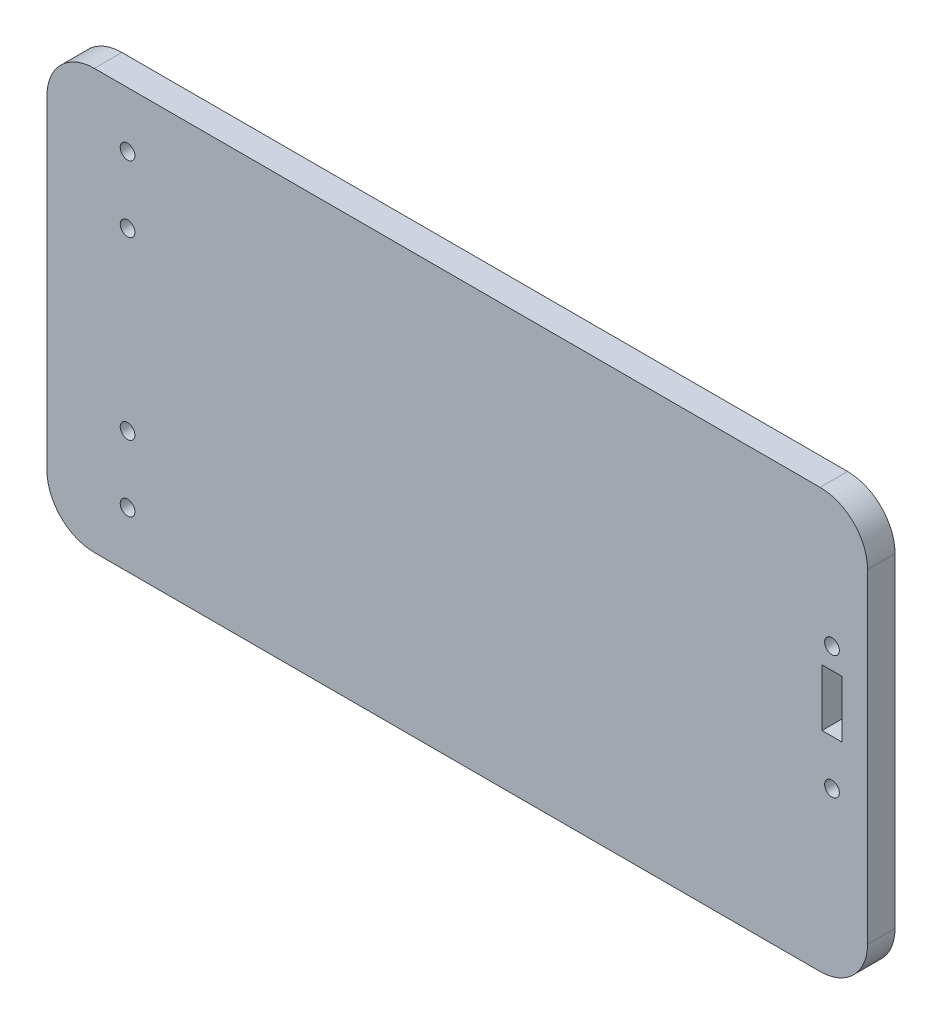
ISO-10303-21;
HEADER;
FILE_DESCRIPTION(('STEP AP214'),'2;1');
FILE_NAME('part.step','',(''),(''),'','','');
FILE_SCHEMA(('AUTOMOTIVE_DESIGN { 1 0 10303 214 1 1 1 1 }'));
ENDSEC;
DATA;
#1=APPLICATION_CONTEXT('core data for automotive mechanical design processes');
#2=APPLICATION_PROTOCOL_DEFINITION('international standard','automotive_design',2000,#1);
#3=PRODUCT_CONTEXT('',#1,'mechanical');
#4=PRODUCT('Part','Part','',(#3));
#5=PRODUCT_RELATED_PRODUCT_CATEGORY('part','',(#4));
#6=PRODUCT_DEFINITION_FORMATION('','',#4);
#7=PRODUCT_DEFINITION_CONTEXT('part definition',#1,'design');
#8=PRODUCT_DEFINITION('design','',#6,#7);
#9=PRODUCT_DEFINITION_SHAPE('','',#8);
#10=(LENGTH_UNIT() NAMED_UNIT(*) SI_UNIT(.MILLI.,.METRE.));
#11=(NAMED_UNIT(*) PLANE_ANGLE_UNIT() SI_UNIT($,.RADIAN.));
#12=(NAMED_UNIT(*) SI_UNIT($,.STERADIAN.) SOLID_ANGLE_UNIT());
#13=UNCERTAINTY_MEASURE_WITH_UNIT(LENGTH_MEASURE(1.E-05),#10,'distance_accuracy_value','');
#14=(GEOMETRIC_REPRESENTATION_CONTEXT(3) GLOBAL_UNCERTAINTY_ASSIGNED_CONTEXT((#13)) GLOBAL_UNIT_ASSIGNED_CONTEXT((#10,
#11,#12)) REPRESENTATION_CONTEXT('',''));
#15=CARTESIAN_POINT('',(0.,0.,0.));
#16=DIRECTION('',(0.,0.,1.));
#17=DIRECTION('',(1.,0.,0.));
#18=AXIS2_PLACEMENT_3D('',#15,#16,#17);
#19=CARTESIAN_POINT('',(163.,34.2,5.8));
#20=DIRECTION('',(0.,0.,-1.));
#21=DIRECTION('',(-1.,0.,0.));
#22=AXIS2_PLACEMENT_3D('',#19,#20,#21);
#23=CYLINDRICAL_SURFACE('',#22,10.);
#24=CARTESIAN_POINT('',(163.,34.2,0.));
#25=DIRECTION('',(0.,0.,1.));
#26=DIRECTION('',(1.,0.,0.));
#27=AXIS2_PLACEMENT_3D('',#24,#25,#26);
#28=CIRCLE('',#27,10.);
#29=CARTESIAN_POINT('',(173.,34.2,0.));
#30=VERTEX_POINT('',#29);
#31=CARTESIAN_POINT('',(163.,44.2,0.));
#32=VERTEX_POINT('',#31);
#33=EDGE_CURVE('E159',#30,#32,#28,.T.);
#34=ORIENTED_EDGE('',*,*,#33,.T.);
#35=DIRECTION('',(0.,0.,-1.));
#36=VECTOR('',#35,1.);
#37=CARTESIAN_POINT('',(163.,44.2,5.8));
#38=LINE('',#37,#36);
#39=CARTESIAN_POINT('',(163.,44.2,5.8));
#40=VERTEX_POINT('',#39);
#41=EDGE_CURVE('E241',#40,#32,#38,.T.);
#42=ORIENTED_EDGE('',*,*,#41,.F.);
#43=CARTESIAN_POINT('',(163.,34.2,5.8));
#44=DIRECTION('',(0.,0.,1.));
#45=DIRECTION('',(1.,0.,0.));
#46=AXIS2_PLACEMENT_3D('',#43,#44,#45);
#47=CIRCLE('',#46,10.);
#48=CARTESIAN_POINT('',(173.,34.2,5.8));
#49=VERTEX_POINT('',#48);
#50=EDGE_CURVE('E164',#49,#40,#47,.T.);
#51=ORIENTED_EDGE('',*,*,#50,.F.);
#52=DIRECTION('',(0.,0.,-1.));
#53=VECTOR('',#52,1.);
#54=CARTESIAN_POINT('',(173.,34.2,5.8));
#55=LINE('',#54,#53);
#56=EDGE_CURVE('E190',#49,#30,#55,.T.);
#57=ORIENTED_EDGE('',*,*,#56,.T.);
#58=EDGE_LOOP('',(#34,#42,#51,#57));
#59=FACE_BOUND('',#58,.T.);
#60=ADVANCED_FACE('F39',(#59),#23,.T.);
#61=CARTESIAN_POINT('',(163.,44.2,5.8));
#62=DIRECTION('',(0.,-1.,0.));
#63=DIRECTION('',(1.,0.,0.));
#64=AXIS2_PLACEMENT_3D('',#61,#62,#63);
#65=PLANE('',#64);
#66=DIRECTION('',(-1.,0.,0.));
#67=VECTOR('',#66,1.);
#68=CARTESIAN_POINT('',(163.,44.2,0.));
#69=LINE('',#68,#67);
#70=CARTESIAN_POINT('',(10.,44.2,0.));
#71=VERTEX_POINT('',#70);
#72=EDGE_CURVE('E194',#32,#71,#69,.T.);
#73=ORIENTED_EDGE('',*,*,#72,.T.);
#74=DIRECTION('',(0.,0.,-1.));
#75=VECTOR('',#74,1.);
#76=CARTESIAN_POINT('',(10.,44.2,5.8));
#77=LINE('',#76,#75);
#78=CARTESIAN_POINT('',(10.,44.2,5.8));
#79=VERTEX_POINT('',#78);
#80=EDGE_CURVE('E237',#79,#71,#77,.T.);
#81=ORIENTED_EDGE('',*,*,#80,.F.);
#82=DIRECTION('',(-1.,0.,0.));
#83=VECTOR('',#82,1.);
#84=CARTESIAN_POINT('',(163.,44.2,5.8));
#85=LINE('',#84,#83);
#86=EDGE_CURVE('E168',#40,#79,#85,.T.);
#87=ORIENTED_EDGE('',*,*,#86,.F.);
#88=ORIENTED_EDGE('',*,*,#41,.T.);
#89=EDGE_LOOP('',(#73,#81,#87,#88));
#90=FACE_BOUND('',#89,.T.);
#91=ADVANCED_FACE('F270',(#90),#65,.F.);
#92=CARTESIAN_POINT('',(10.,34.2,5.8));
#93=DIRECTION('',(0.,0.,-1.));
#94=DIRECTION('',(-1.,0.,0.));
#95=AXIS2_PLACEMENT_3D('',#92,#93,#94);
#96=CYLINDRICAL_SURFACE('',#95,10.);
#97=CARTESIAN_POINT('',(10.,34.2,0.));
#98=DIRECTION('',(0.,0.,1.));
#99=DIRECTION('',(1.,0.,0.));
#100=AXIS2_PLACEMENT_3D('',#97,#98,#99);
#101=CIRCLE('',#100,10.);
#102=CARTESIAN_POINT('',(0.,34.2,0.));
#103=VERTEX_POINT('',#102);
#104=EDGE_CURVE('E197',#71,#103,#101,.T.);
#105=ORIENTED_EDGE('',*,*,#104,.T.);
#106=DIRECTION('',(0.,0.,-1.));
#107=VECTOR('',#106,1.);
#108=CARTESIAN_POINT('',(0.,34.2,5.8));
#109=LINE('',#108,#107);
#110=CARTESIAN_POINT('',(0.,34.2,5.8));
#111=VERTEX_POINT('',#110);
#112=EDGE_CURVE('E233',#111,#103,#109,.T.);
#113=ORIENTED_EDGE('',*,*,#112,.F.);
#114=CARTESIAN_POINT('',(10.,34.2,5.8));
#115=DIRECTION('',(0.,0.,1.));
#116=DIRECTION('',(1.,0.,0.));
#117=AXIS2_PLACEMENT_3D('',#114,#115,#116);
#118=CIRCLE('',#117,10.);
#119=EDGE_CURVE('E172',#79,#111,#118,.T.);
#120=ORIENTED_EDGE('',*,*,#119,.F.);
#121=ORIENTED_EDGE('',*,*,#80,.T.);
#122=EDGE_LOOP('',(#105,#113,#120,#121));
#123=FACE_BOUND('',#122,.T.);
#124=ADVANCED_FACE('F275',(#123),#96,.T.);
#125=CARTESIAN_POINT('',(0.,34.2,5.8));
#126=DIRECTION('',(1.,0.,0.));
#127=DIRECTION('',(0.,0.,-1.));
#128=AXIS2_PLACEMENT_3D('',#125,#126,#127);
#129=PLANE('',#128);
#130=DIRECTION('',(0.,-1.,0.));
#131=VECTOR('',#130,1.);
#132=CARTESIAN_POINT('',(0.,34.2,0.));
#133=LINE('',#132,#131);
#134=CARTESIAN_POINT('',(0.,-34.2,0.));
#135=VERTEX_POINT('',#134);
#136=EDGE_CURVE('E200',#103,#135,#133,.T.);
#137=ORIENTED_EDGE('',*,*,#136,.T.);
#138=DIRECTION('',(0.,0.,-1.));
#139=VECTOR('',#138,1.);
#140=CARTESIAN_POINT('',(0.,-34.2,5.8));
#141=LINE('',#140,#139);
#142=CARTESIAN_POINT('',(0.,-34.2,5.8));
#143=VERTEX_POINT('',#142);
#144=EDGE_CURVE('E229',#143,#135,#141,.T.);
#145=ORIENTED_EDGE('',*,*,#144,.F.);
#146=DIRECTION('',(0.,-1.,0.));
#147=VECTOR('',#146,1.);
#148=CARTESIAN_POINT('',(0.,34.2,5.8));
#149=LINE('',#148,#147);
#150=EDGE_CURVE('E175',#111,#143,#149,.T.);
#151=ORIENTED_EDGE('',*,*,#150,.F.);
#152=ORIENTED_EDGE('',*,*,#112,.T.);
#153=EDGE_LOOP('',(#137,#145,#151,#152));
#154=FACE_BOUND('',#153,.T.);
#155=ADVANCED_FACE('F307',(#154),#129,.F.);
#156=CARTESIAN_POINT('',(10.,-34.2,5.8));
#157=DIRECTION('',(0.,0.,-1.));
#158=DIRECTION('',(-1.,0.,0.));
#159=AXIS2_PLACEMENT_3D('',#156,#157,#158);
#160=CYLINDRICAL_SURFACE('',#159,10.);
#161=CARTESIAN_POINT('',(10.,-34.2,0.));
#162=DIRECTION('',(0.,0.,1.));
#163=DIRECTION('',(1.,0.,0.));
#164=AXIS2_PLACEMENT_3D('',#161,#162,#163);
#165=CIRCLE('',#164,10.);
#166=CARTESIAN_POINT('',(10.,-44.2,0.));
#167=VERTEX_POINT('',#166);
#168=EDGE_CURVE('E203',#135,#167,#165,.T.);
#169=ORIENTED_EDGE('',*,*,#168,.T.);
#170=DIRECTION('',(0.,0.,-1.));
#171=VECTOR('',#170,1.);
#172=CARTESIAN_POINT('',(10.,-44.2,5.8));
#173=LINE('',#172,#171);
#174=CARTESIAN_POINT('',(10.,-44.2,5.8));
#175=VERTEX_POINT('',#174);
#176=EDGE_CURVE('E225',#175,#167,#173,.T.);
#177=ORIENTED_EDGE('',*,*,#176,.F.);
#178=CARTESIAN_POINT('',(10.,-34.2,5.8));
#179=DIRECTION('',(0.,0.,1.));
#180=DIRECTION('',(1.,0.,0.));
#181=AXIS2_PLACEMENT_3D('',#178,#179,#180);
#182=CIRCLE('',#181,10.);
#183=EDGE_CURVE('E178',#143,#175,#182,.T.);
#184=ORIENTED_EDGE('',*,*,#183,.F.);
#185=ORIENTED_EDGE('',*,*,#144,.T.);
#186=EDGE_LOOP('',(#169,#177,#184,#185));
#187=FACE_BOUND('',#186,.T.);
#188=ADVANCED_FACE('F303',(#187),#160,.T.);
#189=CARTESIAN_POINT('',(163.,-44.2,5.8));
#190=DIRECTION('',(0.,1.,0.));
#191=DIRECTION('',(-1.,0.,0.));
#192=AXIS2_PLACEMENT_3D('',#189,#190,#191);
#193=PLANE('',#192);
#194=DIRECTION('',(1.,0.,0.));
#195=VECTOR('',#194,1.);
#196=CARTESIAN_POINT('',(163.,-44.2,0.));
#197=LINE('',#196,#195);
#198=CARTESIAN_POINT('',(163.,-44.2,0.));
#199=VERTEX_POINT('',#198);
#200=EDGE_CURVE('E206',#167,#199,#197,.T.);
#201=ORIENTED_EDGE('',*,*,#200,.T.);
#202=DIRECTION('',(0.,0.,-1.));
#203=VECTOR('',#202,1.);
#204=CARTESIAN_POINT('',(163.,-44.2,5.8));
#205=LINE('',#204,#203);
#206=CARTESIAN_POINT('',(163.,-44.2,5.8));
#207=VERTEX_POINT('',#206);
#208=EDGE_CURVE('E221',#207,#199,#205,.T.);
#209=ORIENTED_EDGE('',*,*,#208,.F.);
#210=DIRECTION('',(1.,0.,0.));
#211=VECTOR('',#210,1.);
#212=CARTESIAN_POINT('',(163.,-44.2,5.8));
#213=LINE('',#212,#211);
#214=EDGE_CURVE('E181',#175,#207,#213,.T.);
#215=ORIENTED_EDGE('',*,*,#214,.F.);
#216=ORIENTED_EDGE('',*,*,#176,.T.);
#217=EDGE_LOOP('',(#201,#209,#215,#216));
#218=FACE_BOUND('',#217,.T.);
#219=ADVANCED_FACE('F298',(#218),#193,.F.);
#220=CARTESIAN_POINT('',(163.,-34.2,5.8));
#221=DIRECTION('',(0.,0.,-1.));
#222=DIRECTION('',(-1.,0.,0.));
#223=AXIS2_PLACEMENT_3D('',#220,#221,#222);
#224=CYLINDRICAL_SURFACE('',#223,10.);
#225=CARTESIAN_POINT('',(163.,-34.2,0.));
#226=DIRECTION('',(0.,0.,1.));
#227=DIRECTION('',(1.,0.,0.));
#228=AXIS2_PLACEMENT_3D('',#225,#226,#227);
#229=CIRCLE('',#228,10.);
#230=CARTESIAN_POINT('',(173.,-34.2,0.));
#231=VERTEX_POINT('',#230);
#232=EDGE_CURVE('E209',#199,#231,#229,.T.);
#233=ORIENTED_EDGE('',*,*,#232,.T.);
#234=DIRECTION('',(0.,0.,-1.));
#235=VECTOR('',#234,1.);
#236=CARTESIAN_POINT('',(173.,-34.2,5.8));
#237=LINE('',#236,#235);
#238=CARTESIAN_POINT('',(173.,-34.2,5.8));
#239=VERTEX_POINT('',#238);
#240=EDGE_CURVE('E217',#239,#231,#237,.T.);
#241=ORIENTED_EDGE('',*,*,#240,.F.);
#242=CARTESIAN_POINT('',(163.,-34.2,5.8));
#243=DIRECTION('',(0.,0.,1.));
#244=DIRECTION('',(1.,0.,0.));
#245=AXIS2_PLACEMENT_3D('',#242,#243,#244);
#246=CIRCLE('',#245,10.);
#247=EDGE_CURVE('E184',#207,#239,#246,.T.);
#248=ORIENTED_EDGE('',*,*,#247,.F.);
#249=ORIENTED_EDGE('',*,*,#208,.T.);
#250=EDGE_LOOP('',(#233,#241,#248,#249));
#251=FACE_BOUND('',#250,.T.);
#252=ADVANCED_FACE('F293',(#251),#224,.T.);
#253=CARTESIAN_POINT('',(173.,34.2,5.8));
#254=DIRECTION('',(-1.,0.,0.));
#255=DIRECTION('',(0.,0.,1.));
#256=AXIS2_PLACEMENT_3D('',#253,#254,#255);
#257=PLANE('',#256);
#258=DIRECTION('',(0.,1.,0.));
#259=VECTOR('',#258,1.);
#260=CARTESIAN_POINT('',(173.,34.2,0.));
#261=LINE('',#260,#259);
#262=EDGE_CURVE('E169',#231,#30,#261,.T.);
#263=ORIENTED_EDGE('',*,*,#262,.T.);
#264=ORIENTED_EDGE('',*,*,#56,.F.);
#265=DIRECTION('',(0.,1.,0.));
#266=VECTOR('',#265,1.);
#267=CARTESIAN_POINT('',(173.,34.2,5.8));
#268=LINE('',#267,#266);
#269=EDGE_CURVE('E187',#239,#49,#268,.T.);
#270=ORIENTED_EDGE('',*,*,#269,.F.);
#271=ORIENTED_EDGE('',*,*,#240,.T.);
#272=EDGE_LOOP('',(#263,#264,#270,#271));
#273=FACE_BOUND('',#272,.T.);
#274=ADVANCED_FACE('F291',(#273),#257,.F.);
#275=CARTESIAN_POINT('',(163.,34.2,5.8));
#276=DIRECTION('',(0.,0.,1.));
#277=DIRECTION('',(1.,0.,0.));
#278=AXIS2_PLACEMENT_3D('',#275,#276,#277);
#279=PLANE('',#278);
#280=CARTESIAN_POINT('',(165.5,16.45,5.8));
#281=DIRECTION('',(0.,0.,1.));
#282=DIRECTION('',(1.,0.,0.));
#283=AXIS2_PLACEMENT_3D('',#280,#281,#282);
#284=CIRCLE('',#283,1.54999999999999);
#285=CARTESIAN_POINT('',(167.05,16.45,5.8));
#286=VERTEX_POINT('',#285);
#287=EDGE_CURVE('E331',#286,#286,#284,.T.);
#288=ORIENTED_EDGE('',*,*,#287,.F.);
#289=EDGE_LOOP('',(#288));
#290=FACE_BOUND('',#289,.T.);
#291=CARTESIAN_POINT('',(165.5,-9.55,5.8));
#292=DIRECTION('',(0.,0.,1.));
#293=DIRECTION('',(1.,0.,0.));
#294=AXIS2_PLACEMENT_3D('',#291,#292,#293);
#295=CIRCLE('',#294,1.54999999999999);
#296=CARTESIAN_POINT('',(167.05,-9.55,5.8));
#297=VERTEX_POINT('',#296);
#298=EDGE_CURVE('E335',#297,#297,#295,.T.);
#299=ORIENTED_EDGE('',*,*,#298,.F.);
#300=EDGE_LOOP('',(#299));
#301=FACE_BOUND('',#300,.T.);
#302=CARTESIAN_POINT('',(17.,32.5,5.8));
#303=DIRECTION('',(0.,0.,1.));
#304=DIRECTION('',(1.,0.,0.));
#305=AXIS2_PLACEMENT_3D('',#302,#303,#304);
#306=CIRCLE('',#305,1.54999999999999);
#307=CARTESIAN_POINT('',(18.55,32.5,5.8));
#308=VERTEX_POINT('',#307);
#309=EDGE_CURVE('E339',#308,#308,#306,.T.);
#310=ORIENTED_EDGE('',*,*,#309,.F.);
#311=EDGE_LOOP('',(#310));
#312=FACE_BOUND('',#311,.T.);
#313=CARTESIAN_POINT('',(17.,18.5,5.8));
#314=DIRECTION('',(0.,0.,1.));
#315=DIRECTION('',(1.,0.,0.));
#316=AXIS2_PLACEMENT_3D('',#313,#314,#315);
#317=CIRCLE('',#316,1.55);
#318=CARTESIAN_POINT('',(18.55,18.5,5.8));
#319=VERTEX_POINT('',#318);
#320=EDGE_CURVE('E343',#319,#319,#317,.T.);
#321=ORIENTED_EDGE('',*,*,#320,.F.);
#322=EDGE_LOOP('',(#321));
#323=FACE_BOUND('',#322,.T.);
#324=CARTESIAN_POINT('',(17.,-18.5,5.8));
#325=DIRECTION('',(0.,0.,1.));
#326=DIRECTION('',(-1.,0.,0.));
#327=AXIS2_PLACEMENT_3D('',#324,#325,#326);
#328=CIRCLE('',#327,1.55);
#329=CARTESIAN_POINT('',(15.45,-18.5,5.8));
#330=VERTEX_POINT('',#329);
#331=EDGE_CURVE('E347',#330,#330,#328,.T.);
#332=ORIENTED_EDGE('',*,*,#331,.F.);
#333=EDGE_LOOP('',(#332));
#334=FACE_BOUND('',#333,.T.);
#335=CARTESIAN_POINT('',(17.,-32.5,5.8));
#336=DIRECTION('',(0.,0.,1.));
#337=DIRECTION('',(-1.,0.,0.));
#338=AXIS2_PLACEMENT_3D('',#335,#336,#337);
#339=CIRCLE('',#338,1.54999999999999);
#340=CARTESIAN_POINT('',(15.45,-32.5,5.8));
#341=VERTEX_POINT('',#340);
#342=EDGE_CURVE('E350',#341,#341,#339,.T.);
#343=ORIENTED_EDGE('',*,*,#342,.F.);
#344=EDGE_LOOP('',(#343));
#345=FACE_BOUND('',#344,.T.);
#346=DIRECTION('',(0.,1.,0.));
#347=VECTOR('',#346,1.);
#348=CARTESIAN_POINT('',(167.6,0.,5.8));
#349=LINE('',#348,#347);
#350=CARTESIAN_POINT('',(167.6,0.,5.8));
#351=VERTEX_POINT('',#350);
#352=CARTESIAN_POINT('',(167.6,12.,5.8));
#353=VERTEX_POINT('',#352);
#354=EDGE_CURVE('E54',#351,#353,#349,.T.);
#355=ORIENTED_EDGE('',*,*,#354,.F.);
#356=DIRECTION('',(1.,0.,0.));
#357=VECTOR('',#356,1.);
#358=CARTESIAN_POINT('',(167.6,0.,5.8));
#359=LINE('',#358,#357);
#360=CARTESIAN_POINT('',(163.4,0.,5.8));
#361=VERTEX_POINT('',#360);
#362=EDGE_CURVE('E149',#361,#351,#359,.T.);
#363=ORIENTED_EDGE('',*,*,#362,.F.);
#364=DIRECTION('',(0.,-1.,0.));
#365=VECTOR('',#364,1.);
#366=CARTESIAN_POINT('',(163.4,0.,5.8));
#367=LINE('',#366,#365);
#368=CARTESIAN_POINT('',(163.4,12.,5.8));
#369=VERTEX_POINT('',#368);
#370=EDGE_CURVE('E131',#369,#361,#367,.T.);
#371=ORIENTED_EDGE('',*,*,#370,.F.);
#372=DIRECTION('',(-1.,0.,0.));
#373=VECTOR('',#372,1.);
#374=CARTESIAN_POINT('',(167.6,12.,5.8));
#375=LINE('',#374,#373);
#376=EDGE_CURVE('E141',#353,#369,#375,.T.);
#377=ORIENTED_EDGE('',*,*,#376,.F.);
#378=EDGE_LOOP('',(#355,#363,#371,#377));
#379=FACE_BOUND('',#378,.T.);
#380=ORIENTED_EDGE('',*,*,#50,.T.);
#381=ORIENTED_EDGE('',*,*,#86,.T.);
#382=ORIENTED_EDGE('',*,*,#119,.T.);
#383=ORIENTED_EDGE('',*,*,#150,.T.);
#384=ORIENTED_EDGE('',*,*,#183,.T.);
#385=ORIENTED_EDGE('',*,*,#214,.T.);
#386=ORIENTED_EDGE('',*,*,#247,.T.);
#387=ORIENTED_EDGE('',*,*,#269,.T.);
#388=EDGE_LOOP('',(#380,#381,#382,#383,#384,#385,#386,#387));
#389=FACE_BOUND('',#388,.T.);
#390=ADVANCED_FACE('F146',(#290,#301,#312,#323,#334,#345,#379,#389),#279,.T.);
#391=CARTESIAN_POINT('',(163.,34.2,0.));
#392=DIRECTION('',(0.,0.,1.));
#393=DIRECTION('',(1.,0.,0.));
#394=AXIS2_PLACEMENT_3D('',#391,#392,#393);
#395=PLANE('',#394);
#396=CARTESIAN_POINT('',(165.5,16.45,0.));
#397=DIRECTION('',(0.,0.,1.));
#398=DIRECTION('',(1.,0.,0.));
#399=AXIS2_PLACEMENT_3D('',#396,#397,#398);
#400=CIRCLE('',#399,1.54999999999999);
#401=CARTESIAN_POINT('',(167.05,16.45,0.));
#402=VERTEX_POINT('',#401);
#403=EDGE_CURVE('E354',#402,#402,#400,.T.);
#404=ORIENTED_EDGE('',*,*,#403,.T.);
#405=EDGE_LOOP('',(#404));
#406=FACE_BOUND('',#405,.T.);
#407=CARTESIAN_POINT('',(165.5,-9.55,0.));
#408=DIRECTION('',(0.,0.,1.));
#409=DIRECTION('',(1.,0.,0.));
#410=AXIS2_PLACEMENT_3D('',#407,#408,#409);
#411=CIRCLE('',#410,1.54999999999999);
#412=CARTESIAN_POINT('',(167.05,-9.55,0.));
#413=VERTEX_POINT('',#412);
#414=EDGE_CURVE('E471',#413,#413,#411,.T.);
#415=ORIENTED_EDGE('',*,*,#414,.T.);
#416=EDGE_LOOP('',(#415));
#417=FACE_BOUND('',#416,.T.);
#418=CARTESIAN_POINT('',(17.,32.5,0.));
#419=DIRECTION('',(0.,0.,1.));
#420=DIRECTION('',(1.,0.,0.));
#421=AXIS2_PLACEMENT_3D('',#418,#419,#420);
#422=CIRCLE('',#421,1.54999999999999);
#423=CARTESIAN_POINT('',(18.55,32.5,0.));
#424=VERTEX_POINT('',#423);
#425=EDGE_CURVE('E364',#424,#424,#422,.T.);
#426=ORIENTED_EDGE('',*,*,#425,.T.);
#427=EDGE_LOOP('',(#426));
#428=FACE_BOUND('',#427,.T.);
#429=CARTESIAN_POINT('',(17.,18.5,0.));
#430=DIRECTION('',(0.,0.,1.));
#431=DIRECTION('',(1.,0.,0.));
#432=AXIS2_PLACEMENT_3D('',#429,#430,#431);
#433=CIRCLE('',#432,1.55);
#434=CARTESIAN_POINT('',(18.55,18.5,0.));
#435=VERTEX_POINT('',#434);
#436=EDGE_CURVE('E371',#435,#435,#433,.T.);
#437=ORIENTED_EDGE('',*,*,#436,.T.);
#438=EDGE_LOOP('',(#437));
#439=FACE_BOUND('',#438,.T.);
#440=CARTESIAN_POINT('',(17.,-18.5,0.));
#441=DIRECTION('',(0.,0.,1.));
#442=DIRECTION('',(-1.,0.,0.));
#443=AXIS2_PLACEMENT_3D('',#440,#441,#442);
#444=CIRCLE('',#443,1.55);
#445=CARTESIAN_POINT('',(15.45,-18.5,0.));
#446=VERTEX_POINT('',#445);
#447=EDGE_CURVE('E381',#446,#446,#444,.T.);
#448=ORIENTED_EDGE('',*,*,#447,.T.);
#449=EDGE_LOOP('',(#448));
#450=FACE_BOUND('',#449,.T.);
#451=CARTESIAN_POINT('',(17.,-32.5,0.));
#452=DIRECTION('',(0.,0.,1.));
#453=DIRECTION('',(-1.,0.,0.));
#454=AXIS2_PLACEMENT_3D('',#451,#452,#453);
#455=CIRCLE('',#454,1.54999999999999);
#456=CARTESIAN_POINT('',(15.45,-32.5,0.));
#457=VERTEX_POINT('',#456);
#458=EDGE_CURVE('E353',#457,#457,#455,.T.);
#459=ORIENTED_EDGE('',*,*,#458,.T.);
#460=EDGE_LOOP('',(#459));
#461=FACE_BOUND('',#460,.T.);
#462=DIRECTION('',(1.,0.,0.));
#463=VECTOR('',#462,1.);
#464=CARTESIAN_POINT('',(163.,0.,0.));
#465=LINE('',#464,#463);
#466=CARTESIAN_POINT('',(163.4,0.,0.));
#467=VERTEX_POINT('',#466);
#468=CARTESIAN_POINT('',(167.6,0.,0.));
#469=VERTEX_POINT('',#468);
#470=EDGE_CURVE('E47',#467,#469,#465,.T.);
#471=ORIENTED_EDGE('',*,*,#470,.T.);
#472=DIRECTION('',(0.,1.,0.));
#473=VECTOR('',#472,1.);
#474=CARTESIAN_POINT('',(167.6,34.2,0.));
#475=LINE('',#474,#473);
#476=CARTESIAN_POINT('',(167.6,12.,0.));
#477=VERTEX_POINT('',#476);
#478=EDGE_CURVE('E11',#469,#477,#475,.T.);
#479=ORIENTED_EDGE('',*,*,#478,.T.);
#480=DIRECTION('',(-1.,0.,0.));
#481=VECTOR('',#480,1.);
#482=CARTESIAN_POINT('',(163.,12.,0.));
#483=LINE('',#482,#481);
#484=CARTESIAN_POINT('',(163.4,12.,0.));
#485=VERTEX_POINT('',#484);
#486=EDGE_CURVE('E245',#477,#485,#483,.T.);
#487=ORIENTED_EDGE('',*,*,#486,.T.);
#488=DIRECTION('',(0.,-1.,0.));
#489=VECTOR('',#488,1.);
#490=CARTESIAN_POINT('',(163.4,34.2,0.));
#491=LINE('',#490,#489);
#492=EDGE_CURVE('E134',#485,#467,#491,.T.);
#493=ORIENTED_EDGE('',*,*,#492,.T.);
#494=EDGE_LOOP('',(#471,#479,#487,#493));
#495=FACE_BOUND('',#494,.T.);
#496=ORIENTED_EDGE('',*,*,#33,.F.);
#497=ORIENTED_EDGE('',*,*,#262,.F.);
#498=ORIENTED_EDGE('',*,*,#232,.F.);
#499=ORIENTED_EDGE('',*,*,#200,.F.);
#500=ORIENTED_EDGE('',*,*,#168,.F.);
#501=ORIENTED_EDGE('',*,*,#136,.F.);
#502=ORIENTED_EDGE('',*,*,#104,.F.);
#503=ORIENTED_EDGE('',*,*,#72,.F.);
#504=EDGE_LOOP('',(#496,#497,#498,#499,#500,#501,#502,#503));
#505=FACE_BOUND('',#504,.T.);
#506=ADVANCED_FACE('F252',(#406,#417,#428,#439,#450,#461,#495,#505),#395,.F.);
#507=CARTESIAN_POINT('',(167.6,0.,-0.55));
#508=DIRECTION('',(1.,0.,0.));
#509=DIRECTION('',(0.,0.,-1.));
#510=AXIS2_PLACEMENT_3D('',#507,#508,#509);
#511=PLANE('',#510);
#512=DIRECTION('',(0.,0.,1.));
#513=VECTOR('',#512,1.);
#514=CARTESIAN_POINT('',(167.6,0.,-0.55));
#515=LINE('',#514,#513);
#516=EDGE_CURVE('E156',#469,#351,#515,.T.);
#517=ORIENTED_EDGE('',*,*,#516,.T.);
#518=ORIENTED_EDGE('',*,*,#354,.T.);
#519=DIRECTION('',(0.,0.,1.));
#520=VECTOR('',#519,1.);
#521=CARTESIAN_POINT('',(167.6,12.,-0.55));
#522=LINE('',#521,#520);
#523=EDGE_CURVE('E138',#477,#353,#522,.T.);
#524=ORIENTED_EDGE('',*,*,#523,.F.);
#525=ORIENTED_EDGE('',*,*,#478,.F.);
#526=EDGE_LOOP('',(#517,#518,#524,#525));
#527=FACE_BOUND('',#526,.T.);
#528=ADVANCED_FACE('F257',(#527),#511,.F.);
#529=CARTESIAN_POINT('',(167.6,0.,-0.55));
#530=DIRECTION('',(0.,-1.,0.));
#531=DIRECTION('',(1.,0.,0.));
#532=AXIS2_PLACEMENT_3D('',#529,#530,#531);
#533=PLANE('',#532);
#534=DIRECTION('',(0.,0.,1.));
#535=VECTOR('',#534,1.);
#536=CARTESIAN_POINT('',(163.4,0.,-0.55));
#537=LINE('',#536,#535);
#538=EDGE_CURVE('E137',#467,#361,#537,.T.);
#539=ORIENTED_EDGE('',*,*,#538,.T.);
#540=ORIENTED_EDGE('',*,*,#362,.T.);
#541=ORIENTED_EDGE('',*,*,#516,.F.);
#542=ORIENTED_EDGE('',*,*,#470,.F.);
#543=EDGE_LOOP('',(#539,#540,#541,#542));
#544=FACE_BOUND('',#543,.T.);
#545=ADVANCED_FACE('F256',(#544),#533,.F.);
#546=CARTESIAN_POINT('',(163.4,0.,-0.55));
#547=DIRECTION('',(-1.,0.,0.));
#548=DIRECTION('',(0.,0.,1.));
#549=AXIS2_PLACEMENT_3D('',#546,#547,#548);
#550=PLANE('',#549);
#551=DIRECTION('',(0.,0.,1.));
#552=VECTOR('',#551,1.);
#553=CARTESIAN_POINT('',(163.4,12.,-0.55));
#554=LINE('',#553,#552);
#555=EDGE_CURVE('E62',#485,#369,#554,.T.);
#556=ORIENTED_EDGE('',*,*,#555,.T.);
#557=ORIENTED_EDGE('',*,*,#370,.T.);
#558=ORIENTED_EDGE('',*,*,#538,.F.);
#559=ORIENTED_EDGE('',*,*,#492,.F.);
#560=EDGE_LOOP('',(#556,#557,#558,#559));
#561=FACE_BOUND('',#560,.T.);
#562=ADVANCED_FACE('F128',(#561),#550,.F.);
#563=CARTESIAN_POINT('',(167.6,12.,-0.55));
#564=DIRECTION('',(0.,1.,0.));
#565=DIRECTION('',(-1.,0.,0.));
#566=AXIS2_PLACEMENT_3D('',#563,#564,#565);
#567=PLANE('',#566);
#568=ORIENTED_EDGE('',*,*,#523,.T.);
#569=ORIENTED_EDGE('',*,*,#376,.T.);
#570=ORIENTED_EDGE('',*,*,#555,.F.);
#571=ORIENTED_EDGE('',*,*,#486,.F.);
#572=EDGE_LOOP('',(#568,#569,#570,#571));
#573=FACE_BOUND('',#572,.T.);
#574=ADVANCED_FACE('F142',(#573),#567,.F.);
#575=CARTESIAN_POINT('',(17.,-32.5,0.));
#576=DIRECTION('',(0.,0.,1.));
#577=DIRECTION('',(1.,0.,0.));
#578=AXIS2_PLACEMENT_3D('',#575,#576,#577);
#579=CYLINDRICAL_SURFACE('',#578,1.54999999999999);
#580=ORIENTED_EDGE('',*,*,#458,.F.);
#581=EDGE_LOOP('',(#580));
#582=FACE_BOUND('',#581,.T.);
#583=ORIENTED_EDGE('',*,*,#342,.T.);
#584=EDGE_LOOP('',(#583));
#585=FACE_BOUND('',#584,.T.);
#586=ADVANCED_FACE('F389',(#582,#585),#579,.F.);
#587=CARTESIAN_POINT('',(17.,-18.5,0.));
#588=DIRECTION('',(0.,0.,1.));
#589=DIRECTION('',(1.,0.,0.));
#590=AXIS2_PLACEMENT_3D('',#587,#588,#589);
#591=CYLINDRICAL_SURFACE('',#590,1.55);
#592=ORIENTED_EDGE('',*,*,#447,.F.);
#593=EDGE_LOOP('',(#592));
#594=FACE_BOUND('',#593,.T.);
#595=ORIENTED_EDGE('',*,*,#331,.T.);
#596=EDGE_LOOP('',(#595));
#597=FACE_BOUND('',#596,.T.);
#598=ADVANCED_FACE('F386',(#594,#597),#591,.F.);
#599=CARTESIAN_POINT('',(17.,18.5,0.));
#600=DIRECTION('',(0.,0.,1.));
#601=DIRECTION('',(1.,0.,0.));
#602=AXIS2_PLACEMENT_3D('',#599,#600,#601);
#603=CYLINDRICAL_SURFACE('',#602,1.55);
#604=ORIENTED_EDGE('',*,*,#436,.F.);
#605=EDGE_LOOP('',(#604));
#606=FACE_BOUND('',#605,.T.);
#607=ORIENTED_EDGE('',*,*,#320,.T.);
#608=EDGE_LOOP('',(#607));
#609=FACE_BOUND('',#608,.T.);
#610=ADVANCED_FACE('F388',(#606,#609),#603,.F.);
#611=CARTESIAN_POINT('',(17.,32.5,0.));
#612=DIRECTION('',(0.,0.,1.));
#613=DIRECTION('',(1.,0.,0.));
#614=AXIS2_PLACEMENT_3D('',#611,#612,#613);
#615=CYLINDRICAL_SURFACE('',#614,1.54999999999999);
#616=ORIENTED_EDGE('',*,*,#425,.F.);
#617=EDGE_LOOP('',(#616));
#618=FACE_BOUND('',#617,.T.);
#619=ORIENTED_EDGE('',*,*,#309,.T.);
#620=EDGE_LOOP('',(#619));
#621=FACE_BOUND('',#620,.T.);
#622=ADVANCED_FACE('F396',(#618,#621),#615,.F.);
#623=CARTESIAN_POINT('',(165.5,-9.55,0.));
#624=DIRECTION('',(0.,0.,1.));
#625=DIRECTION('',(1.,0.,0.));
#626=AXIS2_PLACEMENT_3D('',#623,#624,#625);
#627=CYLINDRICAL_SURFACE('',#626,1.54999999999999);
#628=ORIENTED_EDGE('',*,*,#414,.F.);
#629=EDGE_LOOP('',(#628));
#630=FACE_BOUND('',#629,.T.);
#631=ORIENTED_EDGE('',*,*,#298,.T.);
#632=EDGE_LOOP('',(#631));
#633=FACE_BOUND('',#632,.T.);
#634=ADVANCED_FACE('F432',(#630,#633),#627,.F.);
#635=CARTESIAN_POINT('',(165.5,16.45,0.));
#636=DIRECTION('',(0.,0.,1.));
#637=DIRECTION('',(1.,0.,0.));
#638=AXIS2_PLACEMENT_3D('',#635,#636,#637);
#639=CYLINDRICAL_SURFACE('',#638,1.54999999999999);
#640=ORIENTED_EDGE('',*,*,#403,.F.);
#641=EDGE_LOOP('',(#640));
#642=FACE_BOUND('',#641,.T.);
#643=ORIENTED_EDGE('',*,*,#287,.T.);
#644=EDGE_LOOP('',(#643));
#645=FACE_BOUND('',#644,.T.);
#646=ADVANCED_FACE('F454',(#642,#645),#639,.F.);
#647=CLOSED_SHELL('',(#60,#91,#124,#155,#188,#219,#252,#274,#390,#506,#528,#545,#562,#574,#586,
#598,#610,#622,#634,#646));
#648=MANIFOLD_SOLID_BREP('B2',#647);
#649=ADVANCED_BREP_SHAPE_REPRESENTATION('',(#18,#648),#14);
#650=SHAPE_DEFINITION_REPRESENTATION(#9,#649);
ENDSEC;
END-ISO-10303-21;
